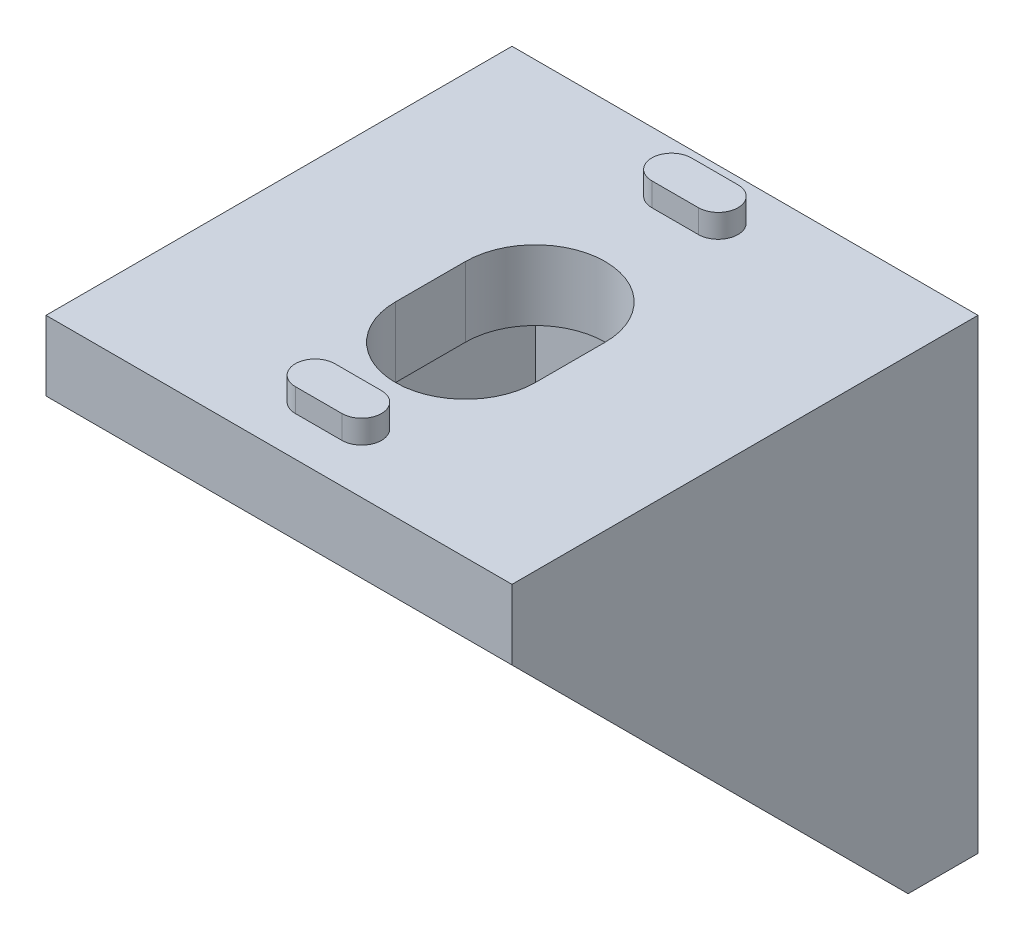
ISO-10303-21;
HEADER;
FILE_DESCRIPTION(('STEP AP214'),'2;1');
FILE_NAME('part.step','',(''),(''),'','','');
FILE_SCHEMA(('AUTOMOTIVE_DESIGN { 1 0 10303 214 1 1 1 1 }'));
ENDSEC;
DATA;
#1=APPLICATION_CONTEXT('core data for automotive mechanical design processes');
#2=APPLICATION_PROTOCOL_DEFINITION('international standard','automotive_design',2000,#1);
#3=PRODUCT_CONTEXT('',#1,'mechanical');
#4=PRODUCT('Part','Part','',(#3));
#5=PRODUCT_RELATED_PRODUCT_CATEGORY('part','',(#4));
#6=PRODUCT_DEFINITION_FORMATION('','',#4);
#7=PRODUCT_DEFINITION_CONTEXT('part definition',#1,'design');
#8=PRODUCT_DEFINITION('design','',#6,#7);
#9=PRODUCT_DEFINITION_SHAPE('','',#8);
#10=(LENGTH_UNIT() NAMED_UNIT(*) SI_UNIT(.MILLI.,.METRE.));
#11=(NAMED_UNIT(*) PLANE_ANGLE_UNIT() SI_UNIT($,.RADIAN.));
#12=(NAMED_UNIT(*) SI_UNIT($,.STERADIAN.) SOLID_ANGLE_UNIT());
#13=UNCERTAINTY_MEASURE_WITH_UNIT(LENGTH_MEASURE(1.E-05),#10,'distance_accuracy_value','');
#14=(GEOMETRIC_REPRESENTATION_CONTEXT(3) GLOBAL_UNCERTAINTY_ASSIGNED_CONTEXT((#13)) GLOBAL_UNIT_ASSIGNED_CONTEXT((#10,
#11,#12)) REPRESENTATION_CONTEXT('',''));
#15=CARTESIAN_POINT('',(0.,0.,0.));
#16=DIRECTION('',(0.,0.,1.));
#17=DIRECTION('',(1.,0.,0.));
#18=AXIS2_PLACEMENT_3D('',#15,#16,#17);
#19=CARTESIAN_POINT('',(10.,0.,0.));
#20=DIRECTION('',(0.,-1.,0.));
#21=DIRECTION('',(0.,0.,-1.));
#22=AXIS2_PLACEMENT_3D('',#19,#20,#21);
#23=PLANE('',#22);
#24=DIRECTION('',(1.,0.,0.));
#25=VECTOR('',#24,1.);
#26=CARTESIAN_POINT('',(0.999999999999997,0.,16.6));
#27=LINE('',#26,#25);
#28=CARTESIAN_POINT('',(-1.,0.,16.6));
#29=VERTEX_POINT('',#28);
#30=CARTESIAN_POINT('',(0.999999999999997,0.,16.6));
#31=VERTEX_POINT('',#30);
#32=EDGE_CURVE('E273',#29,#31,#27,.T.);
#33=ORIENTED_EDGE('',*,*,#32,.T.);
#34=CARTESIAN_POINT('',(0.999999999999995,0.,17.45));
#35=DIRECTION('',(0.,-1.,0.));
#36=DIRECTION('',(0.,0.,-1.));
#37=AXIS2_PLACEMENT_3D('',#34,#35,#36);
#38=CIRCLE('',#37,0.85);
#39=CARTESIAN_POINT('',(0.999999999999997,0.,18.3));
#40=VERTEX_POINT('',#39);
#41=EDGE_CURVE('E247',#31,#40,#38,.T.);
#42=ORIENTED_EDGE('',*,*,#41,.T.);
#43=DIRECTION('',(-1.,0.,0.));
#44=VECTOR('',#43,1.);
#45=CARTESIAN_POINT('',(0.999999999999997,0.,18.3));
#46=LINE('',#45,#44);
#47=CARTESIAN_POINT('',(-0.999999999999999,0.,18.3));
#48=VERTEX_POINT('',#47);
#49=EDGE_CURVE('E263',#40,#48,#46,.T.);
#50=ORIENTED_EDGE('',*,*,#49,.T.);
#51=CARTESIAN_POINT('',(-1.,0.,17.45));
#52=DIRECTION('',(0.,-1.,0.));
#53=DIRECTION('',(0.,0.,1.));
#54=AXIS2_PLACEMENT_3D('',#51,#52,#53);
#55=CIRCLE('',#54,0.85);
#56=EDGE_CURVE('E47',#48,#29,#55,.T.);
#57=ORIENTED_EDGE('',*,*,#56,.T.);
#58=EDGE_LOOP('',(#33,#42,#50,#57));
#59=FACE_BOUND('',#58,.T.);
#60=DIRECTION('',(1.,0.,0.));
#61=VECTOR('',#60,1.);
#62=CARTESIAN_POINT('',(1.,0.,1.3));
#63=LINE('',#62,#61);
#64=CARTESIAN_POINT('',(-1.,0.,1.3));
#65=VERTEX_POINT('',#64);
#66=CARTESIAN_POINT('',(1.,0.,1.3));
#67=VERTEX_POINT('',#66);
#68=EDGE_CURVE('E298',#65,#67,#63,.T.);
#69=ORIENTED_EDGE('',*,*,#68,.T.);
#70=CARTESIAN_POINT('',(1.,0.,2.15));
#71=DIRECTION('',(0.,-1.,0.));
#72=DIRECTION('',(0.,0.,1.));
#73=AXIS2_PLACEMENT_3D('',#70,#71,#72);
#74=CIRCLE('',#73,0.85);
#75=CARTESIAN_POINT('',(1.,0.,3.));
#76=VERTEX_POINT('',#75);
#77=EDGE_CURVE('E252',#67,#76,#74,.T.);
#78=ORIENTED_EDGE('',*,*,#77,.T.);
#79=DIRECTION('',(-1.,0.,0.));
#80=VECTOR('',#79,1.);
#81=CARTESIAN_POINT('',(1.,0.,3.));
#82=LINE('',#81,#80);
#83=CARTESIAN_POINT('',(-0.999999999999999,0.,3.));
#84=VERTEX_POINT('',#83);
#85=EDGE_CURVE('E286',#76,#84,#82,.T.);
#86=ORIENTED_EDGE('',*,*,#85,.T.);
#87=CARTESIAN_POINT('',(-1.,0.,2.15));
#88=DIRECTION('',(0.,-1.,0.));
#89=DIRECTION('',(0.,0.,-1.));
#90=AXIS2_PLACEMENT_3D('',#87,#88,#89);
#91=CIRCLE('',#90,0.85);
#92=EDGE_CURVE('E55',#84,#65,#91,.T.);
#93=ORIENTED_EDGE('',*,*,#92,.T.);
#94=EDGE_LOOP('',(#69,#78,#86,#93));
#95=FACE_BOUND('',#94,.T.);
#96=DIRECTION('',(0.,0.,1.));
#97=VECTOR('',#96,1.);
#98=CARTESIAN_POINT('',(-10.,0.,0.));
#99=LINE('',#98,#97);
#100=CARTESIAN_POINT('',(-10.,0.,0.));
#101=VERTEX_POINT('',#100);
#102=CARTESIAN_POINT('',(-10.,0.,20.));
#103=VERTEX_POINT('',#102);
#104=EDGE_CURVE('E476',#101,#103,#99,.T.);
#105=ORIENTED_EDGE('',*,*,#104,.T.);
#106=DIRECTION('',(-1.,0.,0.));
#107=VECTOR('',#106,1.);
#108=CARTESIAN_POINT('',(10.,0.,20.));
#109=LINE('',#108,#107);
#110=CARTESIAN_POINT('',(10.,0.,20.));
#111=VERTEX_POINT('',#110);
#112=EDGE_CURVE('E495',#111,#103,#109,.T.);
#113=ORIENTED_EDGE('',*,*,#112,.F.);
#114=DIRECTION('',(0.,0.,1.));
#115=VECTOR('',#114,1.);
#116=CARTESIAN_POINT('',(10.,0.,0.));
#117=LINE('',#116,#115);
#118=CARTESIAN_POINT('',(10.,0.,0.));
#119=VERTEX_POINT('',#118);
#120=EDGE_CURVE('E464',#119,#111,#117,.T.);
#121=ORIENTED_EDGE('',*,*,#120,.F.);
#122=DIRECTION('',(-1.,0.,0.));
#123=VECTOR('',#122,1.);
#124=CARTESIAN_POINT('',(10.,0.,0.));
#125=LINE('',#124,#123);
#126=EDGE_CURVE('E498',#119,#101,#125,.T.);
#127=ORIENTED_EDGE('',*,*,#126,.T.);
#128=EDGE_LOOP('',(#105,#113,#121,#127));
#129=FACE_BOUND('',#128,.T.);
#130=CARTESIAN_POINT('',(0.,0.,9.00000000000001));
#131=DIRECTION('',(0.,-1.,0.));
#132=DIRECTION('',(0.,0.,-1.));
#133=AXIS2_PLACEMENT_3D('',#130,#131,#132);
#134=CIRCLE('',#133,3.);
#135=CARTESIAN_POINT('',(-3.,0.,9.));
#136=VERTEX_POINT('',#135);
#137=CARTESIAN_POINT('',(3.,0.,9.));
#138=VERTEX_POINT('',#137);
#139=EDGE_CURVE('E317',#136,#138,#134,.T.);
#140=ORIENTED_EDGE('',*,*,#139,.T.);
#141=DIRECTION('',(0.,0.,1.));
#142=VECTOR('',#141,1.);
#143=CARTESIAN_POINT('',(3.,0.,9.00000000000001));
#144=LINE('',#143,#142);
#145=CARTESIAN_POINT('',(3.,0.,12.));
#146=VERTEX_POINT('',#145);
#147=EDGE_CURVE('E335',#138,#146,#144,.T.);
#148=ORIENTED_EDGE('',*,*,#147,.T.);
#149=CARTESIAN_POINT('',(0.,0.,12.));
#150=DIRECTION('',(0.,-1.,0.));
#151=DIRECTION('',(0.,0.,-1.));
#152=AXIS2_PLACEMENT_3D('',#149,#150,#151);
#153=CIRCLE('',#152,3.);
#154=CARTESIAN_POINT('',(-3.,0.,12.));
#155=VERTEX_POINT('',#154);
#156=EDGE_CURVE('E311',#146,#155,#153,.T.);
#157=ORIENTED_EDGE('',*,*,#156,.T.);
#158=DIRECTION('',(0.,0.,-1.));
#159=VECTOR('',#158,1.);
#160=CARTESIAN_POINT('',(-3.,0.,9.00000000000001));
#161=LINE('',#160,#159);
#162=EDGE_CURVE('E314',#155,#136,#161,.T.);
#163=ORIENTED_EDGE('',*,*,#162,.T.);
#164=EDGE_LOOP('',(#140,#148,#157,#163));
#165=FACE_BOUND('',#164,.T.);
#166=ADVANCED_FACE('F32',(#59,#95,#129,#165),#23,.F.);
#167=CARTESIAN_POINT('',(-6.,-3.,2.99999999999999));
#168=DIRECTION('',(0.,1.,0.));
#169=DIRECTION('',(0.,0.,1.));
#170=AXIS2_PLACEMENT_3D('',#167,#168,#169);
#171=PLANE('',#170);
#172=DIRECTION('',(0.,0.,1.));
#173=VECTOR('',#172,1.);
#174=CARTESIAN_POINT('',(6.,-3.,2.99999999999999));
#175=LINE('',#174,#173);
#176=CARTESIAN_POINT('',(6.,-3.,2.99999999999999));
#177=VERTEX_POINT('',#176);
#178=CARTESIAN_POINT('',(6.,-3.,20.));
#179=VERTEX_POINT('',#178);
#180=EDGE_CURVE('E446',#177,#179,#175,.T.);
#181=ORIENTED_EDGE('',*,*,#180,.T.);
#182=DIRECTION('',(1.,0.,0.));
#183=VECTOR('',#182,1.);
#184=CARTESIAN_POINT('',(-6.,-3.,20.));
#185=LINE('',#184,#183);
#186=CARTESIAN_POINT('',(-6.,-3.,20.));
#187=VERTEX_POINT('',#186);
#188=EDGE_CURVE('E457',#187,#179,#185,.T.);
#189=ORIENTED_EDGE('',*,*,#188,.F.);
#190=DIRECTION('',(0.,0.,1.));
#191=VECTOR('',#190,1.);
#192=CARTESIAN_POINT('',(-6.,-3.,2.99999999999999));
#193=LINE('',#192,#191);
#194=CARTESIAN_POINT('',(-6.,-3.,2.99999999999999));
#195=VERTEX_POINT('',#194);
#196=EDGE_CURVE('E445',#195,#187,#193,.T.);
#197=ORIENTED_EDGE('',*,*,#196,.F.);
#198=DIRECTION('',(1.,0.,0.));
#199=VECTOR('',#198,1.);
#200=CARTESIAN_POINT('',(-6.,-3.,2.99999999999999));
#201=LINE('',#200,#199);
#202=EDGE_CURVE('E449',#195,#177,#201,.T.);
#203=ORIENTED_EDGE('',*,*,#202,.T.);
#204=EDGE_LOOP('',(#181,#189,#197,#203));
#205=FACE_BOUND('',#204,.T.);
#206=CARTESIAN_POINT('',(0.,-3.,9.));
#207=DIRECTION('',(0.,1.,0.));
#208=DIRECTION('',(-1.,0.,0.));
#209=AXIS2_PLACEMENT_3D('',#206,#207,#208);
#210=CIRCLE('',#209,3.);
#211=CARTESIAN_POINT('',(3.,-3.,9.));
#212=VERTEX_POINT('',#211);
#213=CARTESIAN_POINT('',(-3.,-3.,9.));
#214=VERTEX_POINT('',#213);
#215=EDGE_CURVE('E320',#212,#214,#210,.T.);
#216=ORIENTED_EDGE('',*,*,#215,.T.);
#217=DIRECTION('',(0.,0.,1.));
#218=VECTOR('',#217,1.);
#219=CARTESIAN_POINT('',(-3.,-3.,9.));
#220=LINE('',#219,#218);
#221=CARTESIAN_POINT('',(-3.,-3.,12.));
#222=VERTEX_POINT('',#221);
#223=EDGE_CURVE('E329',#214,#222,#220,.T.);
#224=ORIENTED_EDGE('',*,*,#223,.T.);
#225=CARTESIAN_POINT('',(0.,-3.,12.));
#226=DIRECTION('',(0.,1.,0.));
#227=DIRECTION('',(1.,0.,0.));
#228=AXIS2_PLACEMENT_3D('',#225,#226,#227);
#229=CIRCLE('',#228,3.);
#230=CARTESIAN_POINT('',(3.,-3.,12.));
#231=VERTEX_POINT('',#230);
#232=EDGE_CURVE('E326',#222,#231,#229,.T.);
#233=ORIENTED_EDGE('',*,*,#232,.T.);
#234=DIRECTION('',(0.,0.,-1.));
#235=VECTOR('',#234,1.);
#236=CARTESIAN_POINT('',(3.,-3.,9.));
#237=LINE('',#236,#235);
#238=EDGE_CURVE('E323',#231,#212,#237,.T.);
#239=ORIENTED_EDGE('',*,*,#238,.T.);
#240=EDGE_LOOP('',(#216,#224,#233,#239));
#241=FACE_BOUND('',#240,.T.);
#242=ADVANCED_FACE('F508',(#205,#241),#171,.F.);
#243=CARTESIAN_POINT('',(10.,0.,0.));
#244=DIRECTION('',(0.,0.,1.));
#245=DIRECTION('',(0.,-1.,0.));
#246=AXIS2_PLACEMENT_3D('',#243,#244,#245);
#247=PLANE('',#246);
#248=CARTESIAN_POINT('',(1.,-2.15,0.));
#249=DIRECTION('',(0.,0.,-1.));
#250=DIRECTION('',(0.,-1.,0.));
#251=AXIS2_PLACEMENT_3D('',#248,#249,#250);
#252=CIRCLE('',#251,0.85);
#253=CARTESIAN_POINT('',(1.,-1.3,0.));
#254=VERTEX_POINT('',#253);
#255=CARTESIAN_POINT('',(1.,-3.,0.));
#256=VERTEX_POINT('',#255);
#257=EDGE_CURVE('E377',#254,#256,#252,.T.);
#258=ORIENTED_EDGE('',*,*,#257,.F.);
#259=DIRECTION('',(1.,0.,0.));
#260=VECTOR('',#259,1.);
#261=CARTESIAN_POINT('',(1.,-1.3,0.));
#262=LINE('',#261,#260);
#263=CARTESIAN_POINT('',(-0.999999999999999,-1.3,0.));
#264=VERTEX_POINT('',#263);
#265=EDGE_CURVE('E382',#264,#254,#262,.T.);
#266=ORIENTED_EDGE('',*,*,#265,.F.);
#267=CARTESIAN_POINT('',(-1.,-2.15,0.));
#268=DIRECTION('',(0.,0.,-1.));
#269=DIRECTION('',(0.,1.,0.));
#270=AXIS2_PLACEMENT_3D('',#267,#268,#269);
#271=CIRCLE('',#270,0.85);
#272=CARTESIAN_POINT('',(-1.,-3.,0.));
#273=VERTEX_POINT('',#272);
#274=EDGE_CURVE('E394',#273,#264,#271,.T.);
#275=ORIENTED_EDGE('',*,*,#274,.F.);
#276=DIRECTION('',(-1.,0.,0.));
#277=VECTOR('',#276,1.);
#278=CARTESIAN_POINT('',(1.,-3.,0.));
#279=LINE('',#278,#277);
#280=EDGE_CURVE('E391',#256,#273,#279,.T.);
#281=ORIENTED_EDGE('',*,*,#280,.F.);
#282=EDGE_LOOP('',(#258,#266,#275,#281));
#283=FACE_BOUND('',#282,.T.);
#284=DIRECTION('',(0.,-1.,0.));
#285=VECTOR('',#284,1.);
#286=CARTESIAN_POINT('',(3.,-9.00000000000001,0.));
#287=LINE('',#286,#285);
#288=CARTESIAN_POINT('',(3.,-9.00000000000001,0.));
#289=VERTEX_POINT('',#288);
#290=CARTESIAN_POINT('',(3.,-12.,0.));
#291=VERTEX_POINT('',#290);
#292=EDGE_CURVE('E412',#289,#291,#287,.T.);
#293=ORIENTED_EDGE('',*,*,#292,.F.);
#294=CARTESIAN_POINT('',(0.,-9.00000000000001,0.));
#295=DIRECTION('',(0.,0.,1.));
#296=DIRECTION('',(0.,-1.,0.));
#297=AXIS2_PLACEMENT_3D('',#294,#295,#296);
#298=CIRCLE('',#297,3.);
#299=CARTESIAN_POINT('',(-3.,-9.00000000000001,0.));
#300=VERTEX_POINT('',#299);
#301=EDGE_CURVE('E415',#300,#289,#298,.F.);
#302=ORIENTED_EDGE('',*,*,#301,.F.);
#303=DIRECTION('',(0.,1.,0.));
#304=VECTOR('',#303,1.);
#305=CARTESIAN_POINT('',(-3.,-9.00000000000001,0.));
#306=LINE('',#305,#304);
#307=CARTESIAN_POINT('',(-3.,-12.,0.));
#308=VERTEX_POINT('',#307);
#309=EDGE_CURVE('E432',#308,#300,#306,.T.);
#310=ORIENTED_EDGE('',*,*,#309,.F.);
#311=CARTESIAN_POINT('',(0.,-12.,0.));
#312=DIRECTION('',(0.,0.,1.));
#313=DIRECTION('',(0.,-1.,0.));
#314=AXIS2_PLACEMENT_3D('',#311,#312,#313);
#315=CIRCLE('',#314,3.);
#316=EDGE_CURVE('E410',#291,#308,#315,.F.);
#317=ORIENTED_EDGE('',*,*,#316,.F.);
#318=EDGE_LOOP('',(#293,#302,#310,#317));
#319=FACE_BOUND('',#318,.T.);
#320=DIRECTION('',(0.,1.,0.));
#321=VECTOR('',#320,1.);
#322=CARTESIAN_POINT('',(-10.,0.,0.));
#323=LINE('',#322,#321);
#324=CARTESIAN_POINT('',(-10.,-20.,0.));
#325=VERTEX_POINT('',#324);
#326=EDGE_CURVE('E456',#325,#101,#323,.T.);
#327=ORIENTED_EDGE('',*,*,#326,.T.);
#328=ORIENTED_EDGE('',*,*,#126,.F.);
#329=DIRECTION('',(0.,1.,0.));
#330=VECTOR('',#329,1.);
#331=CARTESIAN_POINT('',(10.,0.,0.));
#332=LINE('',#331,#330);
#333=CARTESIAN_POINT('',(10.,-20.,0.));
#334=VERTEX_POINT('',#333);
#335=EDGE_CURVE('E461',#334,#119,#332,.T.);
#336=ORIENTED_EDGE('',*,*,#335,.F.);
#337=DIRECTION('',(-1.,0.,0.));
#338=VECTOR('',#337,1.);
#339=CARTESIAN_POINT('',(10.,-20.,0.));
#340=LINE('',#339,#338);
#341=EDGE_CURVE('E473',#334,#325,#340,.T.);
#342=ORIENTED_EDGE('',*,*,#341,.T.);
#343=EDGE_LOOP('',(#327,#328,#336,#342));
#344=FACE_BOUND('',#343,.T.);
#345=CARTESIAN_POINT('',(0.999999999999995,-17.45,0.));
#346=DIRECTION('',(0.,0.,-1.));
#347=DIRECTION('',(0.,1.,0.));
#348=AXIS2_PLACEMENT_3D('',#345,#346,#347);
#349=CIRCLE('',#348,0.85);
#350=CARTESIAN_POINT('',(0.999999999999997,-16.6,0.));
#351=VERTEX_POINT('',#350);
#352=CARTESIAN_POINT('',(0.999999999999997,-18.3,0.));
#353=VERTEX_POINT('',#352);
#354=EDGE_CURVE('E344',#351,#353,#349,.T.);
#355=ORIENTED_EDGE('',*,*,#354,.F.);
#356=DIRECTION('',(1.,0.,0.));
#357=VECTOR('',#356,1.);
#358=CARTESIAN_POINT('',(0.999999999999997,-16.6,0.));
#359=LINE('',#358,#357);
#360=CARTESIAN_POINT('',(-1.,-16.6,0.));
#361=VERTEX_POINT('',#360);
#362=EDGE_CURVE('E349',#361,#351,#359,.T.);
#363=ORIENTED_EDGE('',*,*,#362,.F.);
#364=CARTESIAN_POINT('',(-1.,-17.45,0.));
#365=DIRECTION('',(0.,0.,-1.));
#366=DIRECTION('',(0.,-1.,0.));
#367=AXIS2_PLACEMENT_3D('',#364,#365,#366);
#368=CIRCLE('',#367,0.85);
#369=CARTESIAN_POINT('',(-1.,-18.3,0.));
#370=VERTEX_POINT('',#369);
#371=EDGE_CURVE('E361',#370,#361,#368,.T.);
#372=ORIENTED_EDGE('',*,*,#371,.F.);
#373=DIRECTION('',(-1.,0.,0.));
#374=VECTOR('',#373,1.);
#375=CARTESIAN_POINT('',(0.999999999999997,-18.3,0.));
#376=LINE('',#375,#374);
#377=EDGE_CURVE('E358',#353,#370,#376,.T.);
#378=ORIENTED_EDGE('',*,*,#377,.F.);
#379=EDGE_LOOP('',(#355,#363,#372,#378));
#380=FACE_BOUND('',#379,.T.);
#381=ADVANCED_FACE('F34',(#283,#319,#344,#380),#247,.F.);
#382=CARTESIAN_POINT('',(10.,-20.,2.99999999999999));
#383=DIRECTION('',(0.,0.707106781186548,-0.707106781186547));
#384=DIRECTION('',(0.,0.707106781186547,0.707106781186548));
#385=AXIS2_PLACEMENT_3D('',#382,#383,#384);
#386=PLANE('',#385);
#387=DIRECTION('',(0.,0.707106781186547,0.707106781186548));
#388=VECTOR('',#387,1.);
#389=CARTESIAN_POINT('',(6.,-20.,2.99999999999999));
#390=LINE('',#389,#388);
#391=CARTESIAN_POINT('',(6.,-20.,2.99999999999999));
#392=VERTEX_POINT('',#391);
#393=EDGE_CURVE('E40',#392,#179,#390,.T.);
#394=ORIENTED_EDGE('',*,*,#393,.F.);
#395=DIRECTION('',(-1.,0.,0.));
#396=VECTOR('',#395,1.);
#397=CARTESIAN_POINT('',(10.,-20.,2.99999999999999));
#398=LINE('',#397,#396);
#399=CARTESIAN_POINT('',(10.,-20.,2.99999999999999));
#400=VERTEX_POINT('',#399);
#401=EDGE_CURVE('E488',#400,#392,#398,.T.);
#402=ORIENTED_EDGE('',*,*,#401,.F.);
#403=DIRECTION('',(0.,-0.707106781186548,-0.707106781186548));
#404=VECTOR('',#403,1.);
#405=CARTESIAN_POINT('',(10.,-3.,20.));
#406=LINE('',#405,#404);
#407=CARTESIAN_POINT('',(10.,-3.,20.));
#408=VERTEX_POINT('',#407);
#409=EDGE_CURVE('E469',#408,#400,#406,.T.);
#410=ORIENTED_EDGE('',*,*,#409,.F.);
#411=DIRECTION('',(-1.,0.,0.));
#412=VECTOR('',#411,1.);
#413=CARTESIAN_POINT('',(10.,-3.,20.));
#414=LINE('',#413,#412);
#415=EDGE_CURVE('E492',#408,#179,#414,.T.);
#416=ORIENTED_EDGE('',*,*,#415,.T.);
#417=EDGE_LOOP('',(#394,#402,#410,#416));
#418=FACE_BOUND('',#417,.T.);
#419=ADVANCED_FACE('F517',(#418),#386,.F.);
#420=CARTESIAN_POINT('',(10.,0.,20.));
#421=DIRECTION('',(0.,0.,-1.));
#422=DIRECTION('',(-1.,0.,0.));
#423=AXIS2_PLACEMENT_3D('',#420,#421,#422);
#424=PLANE('',#423);
#425=DIRECTION('',(0.,-1.,0.));
#426=VECTOR('',#425,1.);
#427=CARTESIAN_POINT('',(-10.,0.,20.));
#428=LINE('',#427,#426);
#429=CARTESIAN_POINT('',(-10.,-3.,20.));
#430=VERTEX_POINT('',#429);
#431=EDGE_CURVE('E478',#103,#430,#428,.T.);
#432=ORIENTED_EDGE('',*,*,#431,.T.);
#433=EDGE_CURVE('E491',#187,#430,#414,.T.);
#434=ORIENTED_EDGE('',*,*,#433,.F.);
#435=ORIENTED_EDGE('',*,*,#188,.T.);
#436=ORIENTED_EDGE('',*,*,#415,.F.);
#437=DIRECTION('',(0.,-1.,0.));
#438=VECTOR('',#437,1.);
#439=CARTESIAN_POINT('',(10.,0.,20.));
#440=LINE('',#439,#438);
#441=EDGE_CURVE('E467',#111,#408,#440,.T.);
#442=ORIENTED_EDGE('',*,*,#441,.F.);
#443=ORIENTED_EDGE('',*,*,#112,.T.);
#444=EDGE_LOOP('',(#432,#434,#435,#436,#442,#443));
#445=FACE_BOUND('',#444,.T.);
#446=ADVANCED_FACE('F514',(#445),#424,.F.);
#447=CARTESIAN_POINT('',(-6.,-20.,2.99999999999999));
#448=VERTEX_POINT('',#447);
#449=CARTESIAN_POINT('',(-10.,-20.,2.99999999999999));
#450=VERTEX_POINT('',#449);
#451=EDGE_CURVE('E487',#448,#450,#398,.T.);
#452=ORIENTED_EDGE('',*,*,#451,.F.);
#453=DIRECTION('',(0.,0.707106781186547,0.707106781186548));
#454=VECTOR('',#453,1.);
#455=CARTESIAN_POINT('',(-6.,-20.,2.99999999999999));
#456=LINE('',#455,#454);
#457=EDGE_CURVE('E11',#448,#187,#456,.T.);
#458=ORIENTED_EDGE('',*,*,#457,.T.);
#459=ORIENTED_EDGE('',*,*,#433,.T.);
#460=DIRECTION('',(0.,-0.707106781186547,-0.707106781186548));
#461=VECTOR('',#460,1.);
#462=CARTESIAN_POINT('',(-10.,-20.,2.99999999999999));
#463=LINE('',#462,#461);
#464=EDGE_CURVE('E481',#430,#450,#463,.T.);
#465=ORIENTED_EDGE('',*,*,#464,.T.);
#466=EDGE_LOOP('',(#452,#458,#459,#465));
#467=FACE_BOUND('',#466,.T.);
#468=ADVANCED_FACE('F532',(#467),#386,.F.);
#469=CARTESIAN_POINT('',(10.,-20.,0.));
#470=DIRECTION('',(0.,1.,0.));
#471=DIRECTION('',(0.,0.,1.));
#472=AXIS2_PLACEMENT_3D('',#469,#470,#471);
#473=PLANE('',#472);
#474=DIRECTION('',(0.,0.,-1.));
#475=VECTOR('',#474,1.);
#476=CARTESIAN_POINT('',(-10.,-20.,0.));
#477=LINE('',#476,#475);
#478=EDGE_CURVE('E465',#450,#325,#477,.T.);
#479=ORIENTED_EDGE('',*,*,#478,.T.);
#480=ORIENTED_EDGE('',*,*,#341,.F.);
#481=DIRECTION('',(0.,0.,-1.));
#482=VECTOR('',#481,1.);
#483=CARTESIAN_POINT('',(10.,-20.,0.));
#484=LINE('',#483,#482);
#485=EDGE_CURVE('E471',#400,#334,#484,.T.);
#486=ORIENTED_EDGE('',*,*,#485,.F.);
#487=ORIENTED_EDGE('',*,*,#401,.T.);
#488=DIRECTION('',(1.,0.,0.));
#489=VECTOR('',#488,1.);
#490=CARTESIAN_POINT('',(-6.,-20.,2.99999999999999));
#491=LINE('',#490,#489);
#492=EDGE_CURVE('E454',#448,#392,#491,.T.);
#493=ORIENTED_EDGE('',*,*,#492,.F.);
#494=ORIENTED_EDGE('',*,*,#451,.T.);
#495=EDGE_LOOP('',(#479,#480,#486,#487,#493,#494));
#496=FACE_BOUND('',#495,.T.);
#497=ADVANCED_FACE('F540',(#496),#473,.F.);
#498=CARTESIAN_POINT('',(10.,0.,0.));
#499=DIRECTION('',(-1.,0.,0.));
#500=DIRECTION('',(0.,0.,1.));
#501=AXIS2_PLACEMENT_3D('',#498,#499,#500);
#502=PLANE('',#501);
#503=ORIENTED_EDGE('',*,*,#335,.T.);
#504=ORIENTED_EDGE('',*,*,#120,.T.);
#505=ORIENTED_EDGE('',*,*,#441,.T.);
#506=ORIENTED_EDGE('',*,*,#409,.T.);
#507=ORIENTED_EDGE('',*,*,#485,.T.);
#508=EDGE_LOOP('',(#503,#504,#505,#506,#507));
#509=FACE_BOUND('',#508,.T.);
#510=ADVANCED_FACE('F520',(#509),#502,.F.);
#511=CARTESIAN_POINT('',(-10.,0.,0.));
#512=DIRECTION('',(-1.,0.,0.));
#513=DIRECTION('',(0.,0.,1.));
#514=AXIS2_PLACEMENT_3D('',#511,#512,#513);
#515=PLANE('',#514);
#516=ORIENTED_EDGE('',*,*,#326,.F.);
#517=ORIENTED_EDGE('',*,*,#478,.F.);
#518=ORIENTED_EDGE('',*,*,#464,.F.);
#519=ORIENTED_EDGE('',*,*,#431,.F.);
#520=ORIENTED_EDGE('',*,*,#104,.F.);
#521=EDGE_LOOP('',(#516,#517,#518,#519,#520));
#522=FACE_BOUND('',#521,.T.);
#523=ADVANCED_FACE('F528',(#522),#515,.T.);
#524=CARTESIAN_POINT('',(-6.,0.,0.));
#525=DIRECTION('',(-1.,0.,0.));
#526=DIRECTION('',(0.,0.,1.));
#527=AXIS2_PLACEMENT_3D('',#524,#525,#526);
#528=PLANE('',#527);
#529=DIRECTION('',(0.,1.,0.));
#530=VECTOR('',#529,1.);
#531=CARTESIAN_POINT('',(-6.,-3.,2.99999999999999));
#532=LINE('',#531,#530);
#533=EDGE_CURVE('E442',#448,#195,#532,.T.);
#534=ORIENTED_EDGE('',*,*,#533,.T.);
#535=ORIENTED_EDGE('',*,*,#196,.T.);
#536=ORIENTED_EDGE('',*,*,#457,.F.);
#537=EDGE_LOOP('',(#534,#535,#536));
#538=FACE_BOUND('',#537,.T.);
#539=ADVANCED_FACE('F536',(#538),#528,.F.);
#540=CARTESIAN_POINT('',(6.,0.,0.));
#541=DIRECTION('',(-1.,0.,0.));
#542=DIRECTION('',(0.,0.,1.));
#543=AXIS2_PLACEMENT_3D('',#540,#541,#542);
#544=PLANE('',#543);
#545=ORIENTED_EDGE('',*,*,#393,.T.);
#546=ORIENTED_EDGE('',*,*,#180,.F.);
#547=DIRECTION('',(0.,1.,0.));
#548=VECTOR('',#547,1.);
#549=CARTESIAN_POINT('',(6.,-3.,2.99999999999999));
#550=LINE('',#549,#548);
#551=EDGE_CURVE('E441',#392,#177,#550,.T.);
#552=ORIENTED_EDGE('',*,*,#551,.F.);
#553=EDGE_LOOP('',(#545,#546,#552));
#554=FACE_BOUND('',#553,.T.);
#555=ADVANCED_FACE('F504',(#554),#544,.T.);
#556=CARTESIAN_POINT('',(-6.,-3.,2.99999999999999));
#557=DIRECTION('',(0.,0.,-1.));
#558=DIRECTION('',(0.,1.,0.));
#559=AXIS2_PLACEMENT_3D('',#556,#557,#558);
#560=PLANE('',#559);
#561=DIRECTION('',(0.,-1.,0.));
#562=VECTOR('',#561,1.);
#563=CARTESIAN_POINT('',(-3.,-9.00000000000001,2.99999999999999));
#564=LINE('',#563,#562);
#565=CARTESIAN_POINT('',(-3.,-9.00000000000001,2.99999999999999));
#566=VERTEX_POINT('',#565);
#567=CARTESIAN_POINT('',(-3.,-12.,2.99999999999999));
#568=VERTEX_POINT('',#567);
#569=EDGE_CURVE('E420',#566,#568,#564,.T.);
#570=ORIENTED_EDGE('',*,*,#569,.F.);
#571=CARTESIAN_POINT('',(0.,-9.00000000000001,2.99999999999999));
#572=DIRECTION('',(0.,0.,1.));
#573=DIRECTION('',(-1.,0.,0.));
#574=AXIS2_PLACEMENT_3D('',#571,#572,#573);
#575=CIRCLE('',#574,3.);
#576=CARTESIAN_POINT('',(3.,-9.00000000000001,2.99999999999999));
#577=VERTEX_POINT('',#576);
#578=EDGE_CURVE('E418',#577,#566,#575,.T.);
#579=ORIENTED_EDGE('',*,*,#578,.F.);
#580=DIRECTION('',(0.,1.,0.));
#581=VECTOR('',#580,1.);
#582=CARTESIAN_POINT('',(3.,-9.00000000000001,2.99999999999999));
#583=LINE('',#582,#581);
#584=CARTESIAN_POINT('',(3.,-12.,2.99999999999999));
#585=VERTEX_POINT('',#584);
#586=EDGE_CURVE('E426',#585,#577,#583,.T.);
#587=ORIENTED_EDGE('',*,*,#586,.F.);
#588=CARTESIAN_POINT('',(0.,-12.,2.99999999999999));
#589=DIRECTION('',(0.,0.,1.));
#590=DIRECTION('',(1.,0.,0.));
#591=AXIS2_PLACEMENT_3D('',#588,#589,#590);
#592=CIRCLE('',#591,3.);
#593=EDGE_CURVE('E423',#568,#585,#592,.T.);
#594=ORIENTED_EDGE('',*,*,#593,.F.);
#595=EDGE_LOOP('',(#570,#579,#587,#594));
#596=FACE_BOUND('',#595,.T.);
#597=ORIENTED_EDGE('',*,*,#551,.T.);
#598=ORIENTED_EDGE('',*,*,#202,.F.);
#599=ORIENTED_EDGE('',*,*,#533,.F.);
#600=ORIENTED_EDGE('',*,*,#492,.T.);
#601=EDGE_LOOP('',(#597,#598,#599,#600));
#602=FACE_BOUND('',#601,.T.);
#603=ADVANCED_FACE('F538',(#596,#602),#560,.F.);
#604=CARTESIAN_POINT('',(0.,-9.00000000000001,-0.00100000000001401));
#605=DIRECTION('',(0.,0.,1.));
#606=DIRECTION('',(1.,0.,0.));
#607=AXIS2_PLACEMENT_3D('',#604,#605,#606);
#608=CYLINDRICAL_SURFACE('',#607,3.);
#609=ORIENTED_EDGE('',*,*,#301,.T.);
#610=DIRECTION('',(0.,0.,1.));
#611=VECTOR('',#610,1.);
#612=CARTESIAN_POINT('',(3.,-9.00000000000001,-0.00100000000001401));
#613=LINE('',#612,#611);
#614=EDGE_CURVE('E430',#289,#577,#613,.T.);
#615=ORIENTED_EDGE('',*,*,#614,.T.);
#616=ORIENTED_EDGE('',*,*,#578,.T.);
#617=DIRECTION('',(0.,0.,1.));
#618=VECTOR('',#617,1.);
#619=CARTESIAN_POINT('',(-3.,-9.00000000000001,-0.00100000000001401));
#620=LINE('',#619,#618);
#621=EDGE_CURVE('E429',#300,#566,#620,.T.);
#622=ORIENTED_EDGE('',*,*,#621,.F.);
#623=EDGE_LOOP('',(#609,#615,#616,#622));
#624=FACE_BOUND('',#623,.T.);
#625=ADVANCED_FACE('F621',(#624),#608,.F.);
#626=CARTESIAN_POINT('',(3.,-9.00000000000001,-0.00100000000001401));
#627=DIRECTION('',(1.,0.,0.));
#628=DIRECTION('',(0.,1.,0.));
#629=AXIS2_PLACEMENT_3D('',#626,#627,#628);
#630=PLANE('',#629);
#631=ORIENTED_EDGE('',*,*,#292,.T.);
#632=DIRECTION('',(0.,0.,1.));
#633=VECTOR('',#632,1.);
#634=CARTESIAN_POINT('',(3.,-12.,-0.00100000000001401));
#635=LINE('',#634,#633);
#636=EDGE_CURVE('E433',#291,#585,#635,.T.);
#637=ORIENTED_EDGE('',*,*,#636,.T.);
#638=ORIENTED_EDGE('',*,*,#586,.T.);
#639=ORIENTED_EDGE('',*,*,#614,.F.);
#640=EDGE_LOOP('',(#631,#637,#638,#639));
#641=FACE_BOUND('',#640,.T.);
#642=ADVANCED_FACE('F617',(#641),#630,.F.);
#643=CARTESIAN_POINT('',(0.,-12.,-0.00100000000001401));
#644=DIRECTION('',(0.,0.,1.));
#645=DIRECTION('',(1.,0.,0.));
#646=AXIS2_PLACEMENT_3D('',#643,#644,#645);
#647=CYLINDRICAL_SURFACE('',#646,3.);
#648=ORIENTED_EDGE('',*,*,#316,.T.);
#649=DIRECTION('',(0.,0.,1.));
#650=VECTOR('',#649,1.);
#651=CARTESIAN_POINT('',(-3.,-12.,-0.00100000000001401));
#652=LINE('',#651,#650);
#653=EDGE_CURVE('E435',#308,#568,#652,.T.);
#654=ORIENTED_EDGE('',*,*,#653,.T.);
#655=ORIENTED_EDGE('',*,*,#593,.T.);
#656=ORIENTED_EDGE('',*,*,#636,.F.);
#657=EDGE_LOOP('',(#648,#654,#655,#656));
#658=FACE_BOUND('',#657,.T.);
#659=ADVANCED_FACE('F620',(#658),#647,.F.);
#660=CARTESIAN_POINT('',(-3.,-9.00000000000001,-0.00100000000001401));
#661=DIRECTION('',(-1.,0.,0.));
#662=DIRECTION('',(0.,-1.,0.));
#663=AXIS2_PLACEMENT_3D('',#660,#661,#662);
#664=PLANE('',#663);
#665=ORIENTED_EDGE('',*,*,#309,.T.);
#666=ORIENTED_EDGE('',*,*,#621,.T.);
#667=ORIENTED_EDGE('',*,*,#569,.T.);
#668=ORIENTED_EDGE('',*,*,#653,.F.);
#669=EDGE_LOOP('',(#665,#666,#667,#668));
#670=FACE_BOUND('',#669,.T.);
#671=ADVANCED_FACE('F615',(#670),#664,.F.);
#672=CARTESIAN_POINT('',(1.,-2.15,-1.));
#673=DIRECTION('',(0.,0.,1.));
#674=DIRECTION('',(0.,-1.,0.));
#675=AXIS2_PLACEMENT_3D('',#672,#673,#674);
#676=CYLINDRICAL_SURFACE('',#675,0.85);
#677=ORIENTED_EDGE('',*,*,#257,.T.);
#678=DIRECTION('',(0.,0.,1.));
#679=VECTOR('',#678,1.);
#680=CARTESIAN_POINT('',(1.,-3.,-1.));
#681=LINE('',#680,#679);
#682=CARTESIAN_POINT('',(1.,-3.,-1.));
#683=VERTEX_POINT('',#682);
#684=EDGE_CURVE('E407',#683,#256,#681,.T.);
#685=ORIENTED_EDGE('',*,*,#684,.F.);
#686=CARTESIAN_POINT('',(1.,-2.15,-1.));
#687=DIRECTION('',(0.,0.,-1.));
#688=DIRECTION('',(0.,-1.,0.));
#689=AXIS2_PLACEMENT_3D('',#686,#687,#688);
#690=CIRCLE('',#689,0.85);
#691=CARTESIAN_POINT('',(1.,-1.3,-1.));
#692=VERTEX_POINT('',#691);
#693=EDGE_CURVE('E378',#692,#683,#690,.T.);
#694=ORIENTED_EDGE('',*,*,#693,.F.);
#695=DIRECTION('',(0.,0.,1.));
#696=VECTOR('',#695,1.);
#697=CARTESIAN_POINT('',(1.,-1.3,-1.));
#698=LINE('',#697,#696);
#699=EDGE_CURVE('E388',#692,#254,#698,.T.);
#700=ORIENTED_EDGE('',*,*,#699,.T.);
#701=EDGE_LOOP('',(#677,#685,#694,#700));
#702=FACE_BOUND('',#701,.T.);
#703=ADVANCED_FACE('F611',(#702),#676,.T.);
#704=CARTESIAN_POINT('',(1.,-3.,-1.));
#705=DIRECTION('',(0.,1.,0.));
#706=DIRECTION('',(0.,0.,1.));
#707=AXIS2_PLACEMENT_3D('',#704,#705,#706);
#708=PLANE('',#707);
#709=ORIENTED_EDGE('',*,*,#280,.T.);
#710=DIRECTION('',(0.,0.,1.));
#711=VECTOR('',#710,1.);
#712=CARTESIAN_POINT('',(-0.999999999999999,-3.,-1.));
#713=LINE('',#712,#711);
#714=CARTESIAN_POINT('',(-0.999999999999999,-3.,-1.));
#715=VERTEX_POINT('',#714);
#716=EDGE_CURVE('E404',#715,#273,#713,.T.);
#717=ORIENTED_EDGE('',*,*,#716,.F.);
#718=DIRECTION('',(-1.,0.,0.));
#719=VECTOR('',#718,1.);
#720=CARTESIAN_POINT('',(1.,-3.,-1.));
#721=LINE('',#720,#719);
#722=EDGE_CURVE('E381',#683,#715,#721,.T.);
#723=ORIENTED_EDGE('',*,*,#722,.F.);
#724=ORIENTED_EDGE('',*,*,#684,.T.);
#725=EDGE_LOOP('',(#709,#717,#723,#724));
#726=FACE_BOUND('',#725,.T.);
#727=ADVANCED_FACE('F607',(#726),#708,.F.);
#728=CARTESIAN_POINT('',(-1.,-2.15,-1.));
#729=DIRECTION('',(0.,0.,1.));
#730=DIRECTION('',(0.,-1.,0.));
#731=AXIS2_PLACEMENT_3D('',#728,#729,#730);
#732=CYLINDRICAL_SURFACE('',#731,0.85);
#733=ORIENTED_EDGE('',*,*,#274,.T.);
#734=DIRECTION('',(0.,0.,1.));
#735=VECTOR('',#734,1.);
#736=CARTESIAN_POINT('',(-1.,-1.3,-1.));
#737=LINE('',#736,#735);
#738=CARTESIAN_POINT('',(-1.,-1.3,-1.));
#739=VERTEX_POINT('',#738);
#740=EDGE_CURVE('E401',#739,#264,#737,.T.);
#741=ORIENTED_EDGE('',*,*,#740,.F.);
#742=CARTESIAN_POINT('',(-1.,-2.15,-1.));
#743=DIRECTION('',(0.,0.,-1.));
#744=DIRECTION('',(0.,1.,0.));
#745=AXIS2_PLACEMENT_3D('',#742,#743,#744);
#746=CIRCLE('',#745,0.85);
#747=EDGE_CURVE('E384',#715,#739,#746,.T.);
#748=ORIENTED_EDGE('',*,*,#747,.F.);
#749=ORIENTED_EDGE('',*,*,#716,.T.);
#750=EDGE_LOOP('',(#733,#741,#748,#749));
#751=FACE_BOUND('',#750,.T.);
#752=ADVANCED_FACE('F603',(#751),#732,.T.);
#753=CARTESIAN_POINT('',(1.,-1.3,-1.));
#754=DIRECTION('',(0.,-1.,0.));
#755=DIRECTION('',(0.,0.,-1.));
#756=AXIS2_PLACEMENT_3D('',#753,#754,#755);
#757=PLANE('',#756);
#758=ORIENTED_EDGE('',*,*,#265,.T.);
#759=ORIENTED_EDGE('',*,*,#699,.F.);
#760=DIRECTION('',(1.,0.,0.));
#761=VECTOR('',#760,1.);
#762=CARTESIAN_POINT('',(1.,-1.3,-1.));
#763=LINE('',#762,#761);
#764=EDGE_CURVE('E386',#739,#692,#763,.T.);
#765=ORIENTED_EDGE('',*,*,#764,.F.);
#766=ORIENTED_EDGE('',*,*,#740,.T.);
#767=EDGE_LOOP('',(#758,#759,#765,#766));
#768=FACE_BOUND('',#767,.T.);
#769=ADVANCED_FACE('F599',(#768),#757,.F.);
#770=CARTESIAN_POINT('',(1.,-2.15,-1.));
#771=DIRECTION('',(0.,0.,1.));
#772=DIRECTION('',(0.,-1.,0.));
#773=AXIS2_PLACEMENT_3D('',#770,#771,#772);
#774=PLANE('',#773);
#775=ORIENTED_EDGE('',*,*,#693,.T.);
#776=ORIENTED_EDGE('',*,*,#722,.T.);
#777=ORIENTED_EDGE('',*,*,#747,.T.);
#778=ORIENTED_EDGE('',*,*,#764,.T.);
#779=EDGE_LOOP('',(#775,#776,#777,#778));
#780=FACE_BOUND('',#779,.T.);
#781=ADVANCED_FACE('F595',(#780),#774,.F.);
#782=CARTESIAN_POINT('',(0.999999999999995,-17.45,-1.00000000000001));
#783=DIRECTION('',(0.,0.,1.));
#784=DIRECTION('',(0.,-1.,0.));
#785=AXIS2_PLACEMENT_3D('',#782,#783,#784);
#786=CYLINDRICAL_SURFACE('',#785,0.85);
#787=ORIENTED_EDGE('',*,*,#354,.T.);
#788=DIRECTION('',(0.,0.,1.));
#789=VECTOR('',#788,1.);
#790=CARTESIAN_POINT('',(0.999999999999997,-18.3,-1.00000000000001));
#791=LINE('',#790,#789);
#792=CARTESIAN_POINT('',(0.999999999999997,-18.3,-1.00000000000001));
#793=VERTEX_POINT('',#792);
#794=EDGE_CURVE('E374',#793,#353,#791,.T.);
#795=ORIENTED_EDGE('',*,*,#794,.F.);
#796=CARTESIAN_POINT('',(0.999999999999995,-17.45,-1.00000000000001));
#797=DIRECTION('',(0.,0.,-1.));
#798=DIRECTION('',(0.,1.,0.));
#799=AXIS2_PLACEMENT_3D('',#796,#797,#798);
#800=CIRCLE('',#799,0.85);
#801=CARTESIAN_POINT('',(0.999999999999997,-16.6,-1.00000000000001));
#802=VERTEX_POINT('',#801);
#803=EDGE_CURVE('E345',#802,#793,#800,.T.);
#804=ORIENTED_EDGE('',*,*,#803,.F.);
#805=DIRECTION('',(0.,0.,1.));
#806=VECTOR('',#805,1.);
#807=CARTESIAN_POINT('',(0.999999999999997,-16.6,-1.00000000000001));
#808=LINE('',#807,#806);
#809=EDGE_CURVE('E355',#802,#351,#808,.T.);
#810=ORIENTED_EDGE('',*,*,#809,.T.);
#811=EDGE_LOOP('',(#787,#795,#804,#810));
#812=FACE_BOUND('',#811,.T.);
#813=ADVANCED_FACE('F591',(#812),#786,.T.);
#814=CARTESIAN_POINT('',(0.999999999999997,-18.3,-1.00000000000001));
#815=DIRECTION('',(0.,1.,0.));
#816=DIRECTION('',(0.,0.,1.));
#817=AXIS2_PLACEMENT_3D('',#814,#815,#816);
#818=PLANE('',#817);
#819=ORIENTED_EDGE('',*,*,#377,.T.);
#820=DIRECTION('',(0.,0.,1.));
#821=VECTOR('',#820,1.);
#822=CARTESIAN_POINT('',(-1.,-18.3,-1.00000000000001));
#823=LINE('',#822,#821);
#824=CARTESIAN_POINT('',(-1.,-18.3,-1.00000000000001));
#825=VERTEX_POINT('',#824);
#826=EDGE_CURVE('E371',#825,#370,#823,.T.);
#827=ORIENTED_EDGE('',*,*,#826,.F.);
#828=DIRECTION('',(-1.,0.,0.));
#829=VECTOR('',#828,1.);
#830=CARTESIAN_POINT('',(0.999999999999997,-18.3,-1.00000000000001));
#831=LINE('',#830,#829);
#832=EDGE_CURVE('E348',#793,#825,#831,.T.);
#833=ORIENTED_EDGE('',*,*,#832,.F.);
#834=ORIENTED_EDGE('',*,*,#794,.T.);
#835=EDGE_LOOP('',(#819,#827,#833,#834));
#836=FACE_BOUND('',#835,.T.);
#837=ADVANCED_FACE('F587',(#836),#818,.F.);
#838=CARTESIAN_POINT('',(-1.,-17.45,-1.00000000000001));
#839=DIRECTION('',(0.,0.,1.));
#840=DIRECTION('',(0.,-1.,0.));
#841=AXIS2_PLACEMENT_3D('',#838,#839,#840);
#842=CYLINDRICAL_SURFACE('',#841,0.85);
#843=ORIENTED_EDGE('',*,*,#371,.T.);
#844=DIRECTION('',(0.,0.,1.));
#845=VECTOR('',#844,1.);
#846=CARTESIAN_POINT('',(-1.,-16.6,-1.00000000000001));
#847=LINE('',#846,#845);
#848=CARTESIAN_POINT('',(-1.,-16.6,-1.00000000000001));
#849=VERTEX_POINT('',#848);
#850=EDGE_CURVE('E368',#849,#361,#847,.T.);
#851=ORIENTED_EDGE('',*,*,#850,.F.);
#852=CARTESIAN_POINT('',(-1.,-17.45,-1.00000000000001));
#853=DIRECTION('',(0.,0.,-1.));
#854=DIRECTION('',(0.,-1.,0.));
#855=AXIS2_PLACEMENT_3D('',#852,#853,#854);
#856=CIRCLE('',#855,0.85);
#857=EDGE_CURVE('E351',#825,#849,#856,.T.);
#858=ORIENTED_EDGE('',*,*,#857,.F.);
#859=ORIENTED_EDGE('',*,*,#826,.T.);
#860=EDGE_LOOP('',(#843,#851,#858,#859));
#861=FACE_BOUND('',#860,.T.);
#862=ADVANCED_FACE('F583',(#861),#842,.T.);
#863=CARTESIAN_POINT('',(0.999999999999997,-16.6,-1.00000000000001));
#864=DIRECTION('',(0.,-1.,0.));
#865=DIRECTION('',(0.,0.,-1.));
#866=AXIS2_PLACEMENT_3D('',#863,#864,#865);
#867=PLANE('',#866);
#868=ORIENTED_EDGE('',*,*,#362,.T.);
#869=ORIENTED_EDGE('',*,*,#809,.F.);
#870=DIRECTION('',(1.,0.,0.));
#871=VECTOR('',#870,1.);
#872=CARTESIAN_POINT('',(0.999999999999997,-16.6,-1.00000000000001));
#873=LINE('',#872,#871);
#874=EDGE_CURVE('E353',#849,#802,#873,.T.);
#875=ORIENTED_EDGE('',*,*,#874,.F.);
#876=ORIENTED_EDGE('',*,*,#850,.T.);
#877=EDGE_LOOP('',(#868,#869,#875,#876));
#878=FACE_BOUND('',#877,.T.);
#879=ADVANCED_FACE('F579',(#878),#867,.F.);
#880=CARTESIAN_POINT('',(0.999999999999995,-17.45,-1.00000000000001));
#881=DIRECTION('',(0.,0.,-1.));
#882=DIRECTION('',(0.,1.,0.));
#883=AXIS2_PLACEMENT_3D('',#880,#881,#882);
#884=PLANE('',#883);
#885=ORIENTED_EDGE('',*,*,#803,.T.);
#886=ORIENTED_EDGE('',*,*,#832,.T.);
#887=ORIENTED_EDGE('',*,*,#857,.T.);
#888=ORIENTED_EDGE('',*,*,#874,.T.);
#889=EDGE_LOOP('',(#885,#886,#887,#888));
#890=FACE_BOUND('',#889,.T.);
#891=ADVANCED_FACE('F576',(#890),#884,.T.);
#892=CARTESIAN_POINT('',(0.,0.00100000000001488,9.00000000000001));
#893=DIRECTION('',(0.,-1.,0.));
#894=DIRECTION('',(0.,0.,-1.));
#895=AXIS2_PLACEMENT_3D('',#892,#893,#894);
#896=CYLINDRICAL_SURFACE('',#895,3.);
#897=DIRECTION('',(0.,-1.,0.));
#898=VECTOR('',#897,1.);
#899=CARTESIAN_POINT('',(-3.,0.00100000000001488,9.00000000000001));
#900=LINE('',#899,#898);
#901=EDGE_CURVE('E333',#136,#214,#900,.T.);
#902=ORIENTED_EDGE('',*,*,#901,.T.);
#903=ORIENTED_EDGE('',*,*,#215,.F.);
#904=DIRECTION('',(0.,-1.,0.));
#905=VECTOR('',#904,1.);
#906=CARTESIAN_POINT('',(3.,0.00100000000001488,9.00000000000001));
#907=LINE('',#906,#905);
#908=EDGE_CURVE('E332',#138,#212,#907,.T.);
#909=ORIENTED_EDGE('',*,*,#908,.F.);
#910=ORIENTED_EDGE('',*,*,#139,.F.);
#911=EDGE_LOOP('',(#902,#903,#909,#910));
#912=FACE_BOUND('',#911,.T.);
#913=ADVANCED_FACE('F551',(#912),#896,.F.);
#914=CARTESIAN_POINT('',(-3.,0.00100000000001488,9.00000000000001));
#915=DIRECTION('',(1.,0.,0.));
#916=DIRECTION('',(0.,0.,-1.));
#917=AXIS2_PLACEMENT_3D('',#914,#915,#916);
#918=PLANE('',#917);
#919=DIRECTION('',(0.,-1.,0.));
#920=VECTOR('',#919,1.);
#921=CARTESIAN_POINT('',(-3.,0.00100000000001141,12.));
#922=LINE('',#921,#920);
#923=EDGE_CURVE('E336',#155,#222,#922,.T.);
#924=ORIENTED_EDGE('',*,*,#923,.T.);
#925=ORIENTED_EDGE('',*,*,#223,.F.);
#926=ORIENTED_EDGE('',*,*,#901,.F.);
#927=ORIENTED_EDGE('',*,*,#162,.F.);
#928=EDGE_LOOP('',(#924,#925,#926,#927));
#929=FACE_BOUND('',#928,.T.);
#930=ADVANCED_FACE('F554',(#929),#918,.T.);
#931=CARTESIAN_POINT('',(0.,0.00100000000001141,12.));
#932=DIRECTION('',(0.,-1.,0.));
#933=DIRECTION('',(0.,0.,-1.));
#934=AXIS2_PLACEMENT_3D('',#931,#932,#933);
#935=CYLINDRICAL_SURFACE('',#934,3.);
#936=DIRECTION('',(0.,-1.,0.));
#937=VECTOR('',#936,1.);
#938=CARTESIAN_POINT('',(3.,0.00100000000001141,12.));
#939=LINE('',#938,#937);
#940=EDGE_CURVE('E338',#146,#231,#939,.T.);
#941=ORIENTED_EDGE('',*,*,#940,.T.);
#942=ORIENTED_EDGE('',*,*,#232,.F.);
#943=ORIENTED_EDGE('',*,*,#923,.F.);
#944=ORIENTED_EDGE('',*,*,#156,.F.);
#945=EDGE_LOOP('',(#941,#942,#943,#944));
#946=FACE_BOUND('',#945,.T.);
#947=ADVANCED_FACE('F562',(#946),#935,.F.);
#948=CARTESIAN_POINT('',(3.,0.00100000000001488,9.00000000000001));
#949=DIRECTION('',(-1.,0.,0.));
#950=DIRECTION('',(0.,0.,1.));
#951=AXIS2_PLACEMENT_3D('',#948,#949,#950);
#952=PLANE('',#951);
#953=ORIENTED_EDGE('',*,*,#908,.T.);
#954=ORIENTED_EDGE('',*,*,#238,.F.);
#955=ORIENTED_EDGE('',*,*,#940,.F.);
#956=ORIENTED_EDGE('',*,*,#147,.F.);
#957=EDGE_LOOP('',(#953,#954,#955,#956));
#958=FACE_BOUND('',#957,.T.);
#959=ADVANCED_FACE('F559',(#958),#952,.T.);
#960=CARTESIAN_POINT('',(1.,0.999999999999999,2.15));
#961=DIRECTION('',(0.,-1.,0.));
#962=DIRECTION('',(0.,0.,-1.));
#963=AXIS2_PLACEMENT_3D('',#960,#961,#962);
#964=CYLINDRICAL_SURFACE('',#963,0.85);
#965=ORIENTED_EDGE('',*,*,#77,.F.);
#966=DIRECTION('',(0.,-1.,0.));
#967=VECTOR('',#966,1.);
#968=CARTESIAN_POINT('',(1.,1.,1.3));
#969=LINE('',#968,#967);
#970=CARTESIAN_POINT('',(1.,1.,1.3));
#971=VERTEX_POINT('',#970);
#972=EDGE_CURVE('E309',#971,#67,#969,.T.);
#973=ORIENTED_EDGE('',*,*,#972,.F.);
#974=CARTESIAN_POINT('',(1.,0.999999999999999,2.15));
#975=DIRECTION('',(0.,-1.,0.));
#976=DIRECTION('',(0.,0.,1.));
#977=AXIS2_PLACEMENT_3D('',#974,#975,#976);
#978=CIRCLE('',#977,0.85);
#979=CARTESIAN_POINT('',(1.,0.999999999999999,3.));
#980=VERTEX_POINT('',#979);
#981=EDGE_CURVE('E282',#971,#980,#978,.T.);
#982=ORIENTED_EDGE('',*,*,#981,.T.);
#983=DIRECTION('',(0.,-1.,0.));
#984=VECTOR('',#983,1.);
#985=CARTESIAN_POINT('',(1.,0.999999999999999,3.));
#986=LINE('',#985,#984);
#987=EDGE_CURVE('E295',#980,#76,#986,.T.);
#988=ORIENTED_EDGE('',*,*,#987,.T.);
#989=EDGE_LOOP('',(#965,#973,#982,#988));
#990=FACE_BOUND('',#989,.T.);
#991=ADVANCED_FACE('F569',(#990),#964,.T.);
#992=CARTESIAN_POINT('',(1.,1.,1.3));
#993=DIRECTION('',(0.,0.,-1.));
#994=DIRECTION('',(0.,1.,0.));
#995=AXIS2_PLACEMENT_3D('',#992,#993,#994);
#996=PLANE('',#995);
#997=ORIENTED_EDGE('',*,*,#68,.F.);
#998=DIRECTION('',(0.,-1.,0.));
#999=VECTOR('',#998,1.);
#1000=CARTESIAN_POINT('',(-1.,1.,1.3));
#1001=LINE('',#1000,#999);
#1002=CARTESIAN_POINT('',(-1.,1.,1.3));
#1003=VERTEX_POINT('',#1002);
#1004=EDGE_CURVE('E307',#1003,#65,#1001,.T.);
#1005=ORIENTED_EDGE('',*,*,#1004,.F.);
#1006=DIRECTION('',(1.,0.,0.));
#1007=VECTOR('',#1006,1.);
#1008=CARTESIAN_POINT('',(1.,1.,1.3));
#1009=LINE('',#1008,#1007);
#1010=EDGE_CURVE('E285',#1003,#971,#1009,.T.);
#1011=ORIENTED_EDGE('',*,*,#1010,.T.);
#1012=ORIENTED_EDGE('',*,*,#972,.T.);
#1013=EDGE_LOOP('',(#997,#1005,#1011,#1012));
#1014=FACE_BOUND('',#1013,.T.);
#1015=ADVANCED_FACE('F855',(#1014),#996,.T.);
#1016=CARTESIAN_POINT('',(-1.,0.999999999999999,2.15));
#1017=DIRECTION('',(0.,-1.,0.));
#1018=DIRECTION('',(0.,0.,-1.));
#1019=AXIS2_PLACEMENT_3D('',#1016,#1017,#1018);
#1020=CYLINDRICAL_SURFACE('',#1019,0.85);
#1021=ORIENTED_EDGE('',*,*,#92,.F.);
#1022=DIRECTION('',(0.,-1.,0.));
#1023=VECTOR('',#1022,1.);
#1024=CARTESIAN_POINT('',(-0.999999999999999,0.999999999999999,3.));
#1025=LINE('',#1024,#1023);
#1026=CARTESIAN_POINT('',(-0.999999999999999,0.999999999999999,3.));
#1027=VERTEX_POINT('',#1026);
#1028=EDGE_CURVE('E305',#1027,#84,#1025,.T.);
#1029=ORIENTED_EDGE('',*,*,#1028,.F.);
#1030=CARTESIAN_POINT('',(-1.,0.999999999999999,2.15));
#1031=DIRECTION('',(0.,-1.,0.));
#1032=DIRECTION('',(0.,0.,-1.));
#1033=AXIS2_PLACEMENT_3D('',#1030,#1031,#1032);
#1034=CIRCLE('',#1033,0.85);
#1035=EDGE_CURVE('E289',#1027,#1003,#1034,.T.);
#1036=ORIENTED_EDGE('',*,*,#1035,.T.);
#1037=ORIENTED_EDGE('',*,*,#1004,.T.);
#1038=EDGE_LOOP('',(#1021,#1029,#1036,#1037));
#1039=FACE_BOUND('',#1038,.T.);
#1040=ADVANCED_FACE('F864',(#1039),#1020,.T.);
#1041=CARTESIAN_POINT('',(1.,0.999999999999999,3.));
#1042=DIRECTION('',(0.,0.,1.));
#1043=DIRECTION('',(0.,-1.,0.));
#1044=AXIS2_PLACEMENT_3D('',#1041,#1042,#1043);
#1045=PLANE('',#1044);
#1046=ORIENTED_EDGE('',*,*,#85,.F.);
#1047=ORIENTED_EDGE('',*,*,#987,.F.);
#1048=DIRECTION('',(-1.,0.,0.));
#1049=VECTOR('',#1048,1.);
#1050=CARTESIAN_POINT('',(1.,0.999999999999999,3.));
#1051=LINE('',#1050,#1049);
#1052=EDGE_CURVE('E292',#980,#1027,#1051,.T.);
#1053=ORIENTED_EDGE('',*,*,#1052,.T.);
#1054=ORIENTED_EDGE('',*,*,#1028,.T.);
#1055=EDGE_LOOP('',(#1046,#1047,#1053,#1054));
#1056=FACE_BOUND('',#1055,.T.);
#1057=ADVANCED_FACE('F874',(#1056),#1045,.T.);
#1058=CARTESIAN_POINT('',(1.,0.999999999999999,2.15));
#1059=DIRECTION('',(0.,-1.,0.));
#1060=DIRECTION('',(0.,0.,1.));
#1061=AXIS2_PLACEMENT_3D('',#1058,#1059,#1060);
#1062=PLANE('',#1061);
#1063=ORIENTED_EDGE('',*,*,#981,.F.);
#1064=ORIENTED_EDGE('',*,*,#1010,.F.);
#1065=ORIENTED_EDGE('',*,*,#1035,.F.);
#1066=ORIENTED_EDGE('',*,*,#1052,.F.);
#1067=EDGE_LOOP('',(#1063,#1064,#1065,#1066));
#1068=FACE_BOUND('',#1067,.T.);
#1069=ADVANCED_FACE('F883',(#1068),#1062,.F.);
#1070=CARTESIAN_POINT('',(0.999999999999995,0.999999999999993,17.45));
#1071=DIRECTION('',(0.,-1.,0.));
#1072=DIRECTION('',(0.,0.,-1.));
#1073=AXIS2_PLACEMENT_3D('',#1070,#1071,#1072);
#1074=CYLINDRICAL_SURFACE('',#1073,0.85);
#1075=ORIENTED_EDGE('',*,*,#41,.F.);
#1076=DIRECTION('',(0.,-1.,0.));
#1077=VECTOR('',#1076,1.);
#1078=CARTESIAN_POINT('',(0.999999999999997,0.999999999999993,16.6));
#1079=LINE('',#1078,#1077);
#1080=CARTESIAN_POINT('',(0.999999999999997,0.999999999999993,16.6));
#1081=VERTEX_POINT('',#1080);
#1082=EDGE_CURVE('E241',#1081,#31,#1079,.T.);
#1083=ORIENTED_EDGE('',*,*,#1082,.F.);
#1084=CARTESIAN_POINT('',(0.999999999999995,0.999999999999993,17.45));
#1085=DIRECTION('',(0.,-1.,0.));
#1086=DIRECTION('',(0.,0.,-1.));
#1087=AXIS2_PLACEMENT_3D('',#1084,#1085,#1086);
#1088=CIRCLE('',#1087,0.85);
#1089=CARTESIAN_POINT('',(0.999999999999997,0.999999999999992,18.3));
#1090=VERTEX_POINT('',#1089);
#1091=EDGE_CURVE('E244',#1081,#1090,#1088,.T.);
#1092=ORIENTED_EDGE('',*,*,#1091,.T.);
#1093=DIRECTION('',(0.,-1.,0.));
#1094=VECTOR('',#1093,1.);
#1095=CARTESIAN_POINT('',(0.999999999999997,0.999999999999992,18.3));
#1096=LINE('',#1095,#1094);
#1097=EDGE_CURVE('E271',#1090,#40,#1096,.T.);
#1098=ORIENTED_EDGE('',*,*,#1097,.T.);
#1099=EDGE_LOOP('',(#1075,#1083,#1092,#1098));
#1100=FACE_BOUND('',#1099,.T.);
#1101=ADVANCED_FACE('F243',(#1100),#1074,.T.);
#1102=CARTESIAN_POINT('',(0.999999999999997,0.999999999999993,16.6));
#1103=DIRECTION('',(0.,0.,-1.));
#1104=DIRECTION('',(0.,1.,0.));
#1105=AXIS2_PLACEMENT_3D('',#1102,#1103,#1104);
#1106=PLANE('',#1105);
#1107=ORIENTED_EDGE('',*,*,#32,.F.);
#1108=DIRECTION('',(0.,-1.,0.));
#1109=VECTOR('',#1108,1.);
#1110=CARTESIAN_POINT('',(-1.,0.999999999999993,16.6));
#1111=LINE('',#1110,#1109);
#1112=CARTESIAN_POINT('',(-1.,0.999999999999993,16.6));
#1113=VERTEX_POINT('',#1112);
#1114=EDGE_CURVE('E253',#1113,#29,#1111,.T.);
#1115=ORIENTED_EDGE('',*,*,#1114,.F.);
#1116=DIRECTION('',(1.,0.,0.));
#1117=VECTOR('',#1116,1.);
#1118=CARTESIAN_POINT('',(0.999999999999997,0.999999999999993,16.6));
#1119=LINE('',#1118,#1117);
#1120=EDGE_CURVE('E259',#1113,#1081,#1119,.T.);
#1121=ORIENTED_EDGE('',*,*,#1120,.T.);
#1122=ORIENTED_EDGE('',*,*,#1082,.T.);
#1123=EDGE_LOOP('',(#1107,#1115,#1121,#1122));
#1124=FACE_BOUND('',#1123,.T.);
#1125=ADVANCED_FACE('F265',(#1124),#1106,.T.);
#1126=CARTESIAN_POINT('',(-1.,0.999999999999993,17.45));
#1127=DIRECTION('',(0.,-1.,0.));
#1128=DIRECTION('',(0.,0.,-1.));
#1129=AXIS2_PLACEMENT_3D('',#1126,#1127,#1128);
#1130=CYLINDRICAL_SURFACE('',#1129,0.85);
#1131=ORIENTED_EDGE('',*,*,#56,.F.);
#1132=DIRECTION('',(0.,-1.,0.));
#1133=VECTOR('',#1132,1.);
#1134=CARTESIAN_POINT('',(-1.,0.999999999999992,18.3));
#1135=LINE('',#1134,#1133);
#1136=CARTESIAN_POINT('',(-1.,0.999999999999992,18.3));
#1137=VERTEX_POINT('',#1136);
#1138=EDGE_CURVE('E279',#1137,#48,#1135,.T.);
#1139=ORIENTED_EDGE('',*,*,#1138,.F.);
#1140=CARTESIAN_POINT('',(-1.,0.999999999999993,17.45));
#1141=DIRECTION('',(0.,-1.,0.));
#1142=DIRECTION('',(0.,0.,1.));
#1143=AXIS2_PLACEMENT_3D('',#1140,#1141,#1142);
#1144=CIRCLE('',#1143,0.85);
#1145=EDGE_CURVE('E266',#1137,#1113,#1144,.T.);
#1146=ORIENTED_EDGE('',*,*,#1145,.T.);
#1147=ORIENTED_EDGE('',*,*,#1114,.T.);
#1148=EDGE_LOOP('',(#1131,#1139,#1146,#1147));
#1149=FACE_BOUND('',#1148,.T.);
#1150=ADVANCED_FACE('F910',(#1149),#1130,.T.);
#1151=CARTESIAN_POINT('',(0.999999999999997,0.999999999999992,18.3));
#1152=DIRECTION('',(0.,0.,1.));
#1153=DIRECTION('',(0.,-1.,0.));
#1154=AXIS2_PLACEMENT_3D('',#1151,#1152,#1153);
#1155=PLANE('',#1154);
#1156=ORIENTED_EDGE('',*,*,#49,.F.);
#1157=ORIENTED_EDGE('',*,*,#1097,.F.);
#1158=DIRECTION('',(-1.,0.,0.));
#1159=VECTOR('',#1158,1.);
#1160=CARTESIAN_POINT('',(0.999999999999997,0.999999999999992,18.3));
#1161=LINE('',#1160,#1159);
#1162=EDGE_CURVE('E262',#1090,#1137,#1161,.T.);
#1163=ORIENTED_EDGE('',*,*,#1162,.T.);
#1164=ORIENTED_EDGE('',*,*,#1138,.T.);
#1165=EDGE_LOOP('',(#1156,#1157,#1163,#1164));
#1166=FACE_BOUND('',#1165,.T.);
#1167=ADVANCED_FACE('F919',(#1166),#1155,.T.);
#1168=CARTESIAN_POINT('',(0.999999999999995,0.999999999999993,17.45));
#1169=DIRECTION('',(0.,1.,0.));
#1170=DIRECTION('',(0.,0.,-1.));
#1171=AXIS2_PLACEMENT_3D('',#1168,#1169,#1170);
#1172=PLANE('',#1171);
#1173=ORIENTED_EDGE('',*,*,#1091,.F.);
#1174=ORIENTED_EDGE('',*,*,#1120,.F.);
#1175=ORIENTED_EDGE('',*,*,#1145,.F.);
#1176=ORIENTED_EDGE('',*,*,#1162,.F.);
#1177=EDGE_LOOP('',(#1173,#1174,#1175,#1176));
#1178=FACE_BOUND('',#1177,.T.);
#1179=ADVANCED_FACE('F257',(#1178),#1172,.T.);
#1180=CLOSED_SHELL('',(#166,#242,#381,#419,#446,#468,#497,#510,#523,#539,#555,#603,#625,#642,
#659,#671,#703,#727,#752,#769,#781,#813,#837,#862,#879,#891,#913,#930,#947,#959,#991,#1015,
#1040,#1057,#1069,#1101,#1125,#1150,#1167,#1179));
#1181=MANIFOLD_SOLID_BREP('B2',#1180);
#1182=ADVANCED_BREP_SHAPE_REPRESENTATION('',(#18,#1181),#14);
#1183=SHAPE_DEFINITION_REPRESENTATION(#9,#1182);
ENDSEC;
END-ISO-10303-21;
